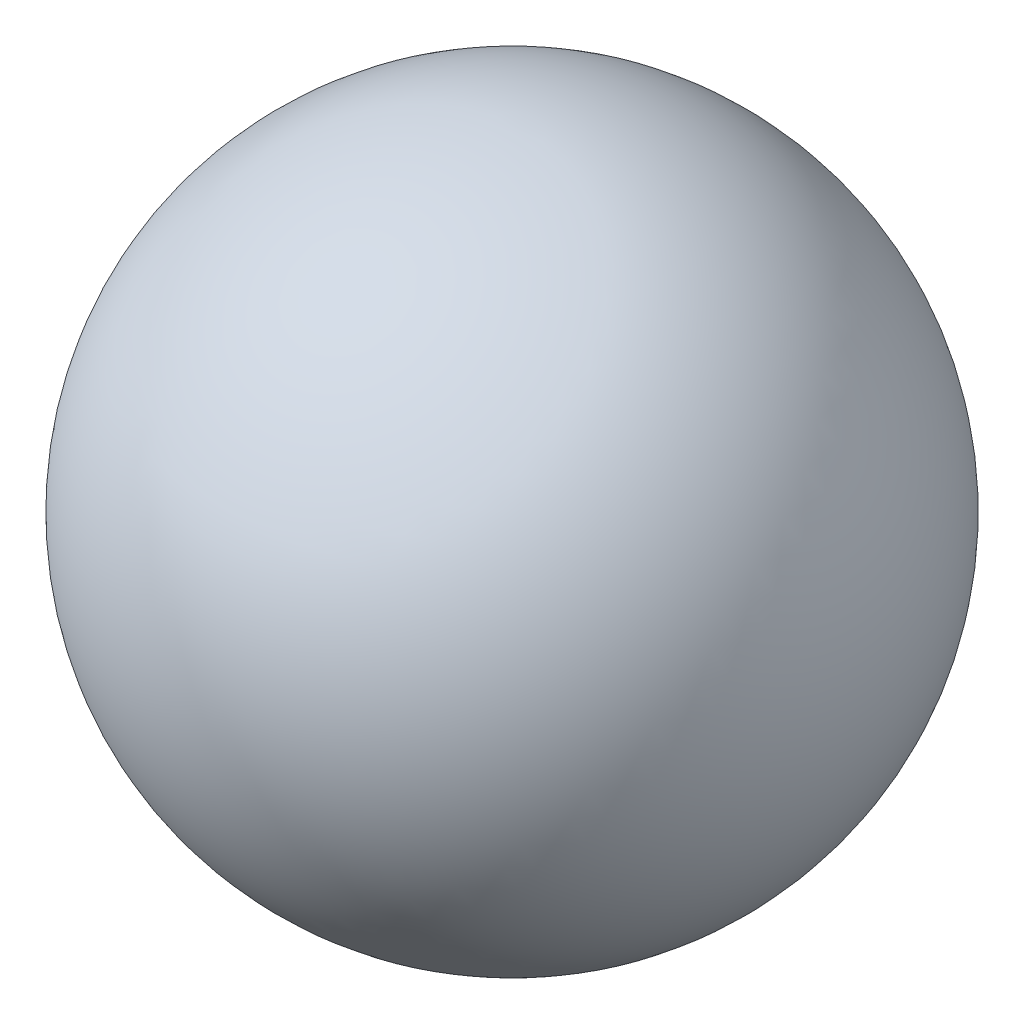
ISO-10303-21;
HEADER;
FILE_DESCRIPTION(('STEP AP214'),'2;1');
FILE_NAME('part.step','',(''),(''),'','','');
FILE_SCHEMA(('AUTOMOTIVE_DESIGN { 1 0 10303 214 1 1 1 1 }'));
ENDSEC;
DATA;
#1=APPLICATION_CONTEXT('core data for automotive mechanical design processes');
#2=APPLICATION_PROTOCOL_DEFINITION('international standard','automotive_design',2000,#1);
#3=PRODUCT_CONTEXT('',#1,'mechanical');
#4=PRODUCT('Part','Part','',(#3));
#5=PRODUCT_RELATED_PRODUCT_CATEGORY('part','',(#4));
#6=PRODUCT_DEFINITION_FORMATION('','',#4);
#7=PRODUCT_DEFINITION_CONTEXT('part definition',#1,'design');
#8=PRODUCT_DEFINITION('design','',#6,#7);
#9=PRODUCT_DEFINITION_SHAPE('','',#8);
#10=(LENGTH_UNIT() NAMED_UNIT(*) SI_UNIT(.MILLI.,.METRE.));
#11=(NAMED_UNIT(*) PLANE_ANGLE_UNIT() SI_UNIT($,.RADIAN.));
#12=(NAMED_UNIT(*) SI_UNIT($,.STERADIAN.) SOLID_ANGLE_UNIT());
#13=UNCERTAINTY_MEASURE_WITH_UNIT(LENGTH_MEASURE(1.E-05),#10,'distance_accuracy_value','');
#14=(GEOMETRIC_REPRESENTATION_CONTEXT(3) GLOBAL_UNCERTAINTY_ASSIGNED_CONTEXT((#13)) GLOBAL_UNIT_ASSIGNED_CONTEXT((#10,
#11,#12)) REPRESENTATION_CONTEXT('',''));
#15=CARTESIAN_POINT('',(0.,0.,0.));
#16=DIRECTION('',(0.,0.,1.));
#17=DIRECTION('',(1.,0.,0.));
#18=AXIS2_PLACEMENT_3D('',#15,#16,#17);
#19=CARTESIAN_POINT('',(0.,0.,0.));
#20=DIRECTION('',(0.,1.,0.));
#21=DIRECTION('',(1.,0.,0.));
#22=AXIS2_PLACEMENT_3D('',#19,#20,#21);
#23=SPHERICAL_SURFACE('',#22,3.95);
#24=CARTESIAN_POINT('',(0.,3.95,0.));
#25=VERTEX_POINT('',#24);
#26=VERTEX_LOOP('',#25);
#27=FACE_BOUND('',#26,.T.);
#28=ADVANCED_FACE('F35',(#27),#23,.T.);
#29=CLOSED_SHELL('',(#28));
#30=MANIFOLD_SOLID_BREP('B2',#29);
#31=ADVANCED_BREP_SHAPE_REPRESENTATION('',(#18,#30),#14);
#32=SHAPE_DEFINITION_REPRESENTATION(#9,#31);
ENDSEC;
END-ISO-10303-21;
